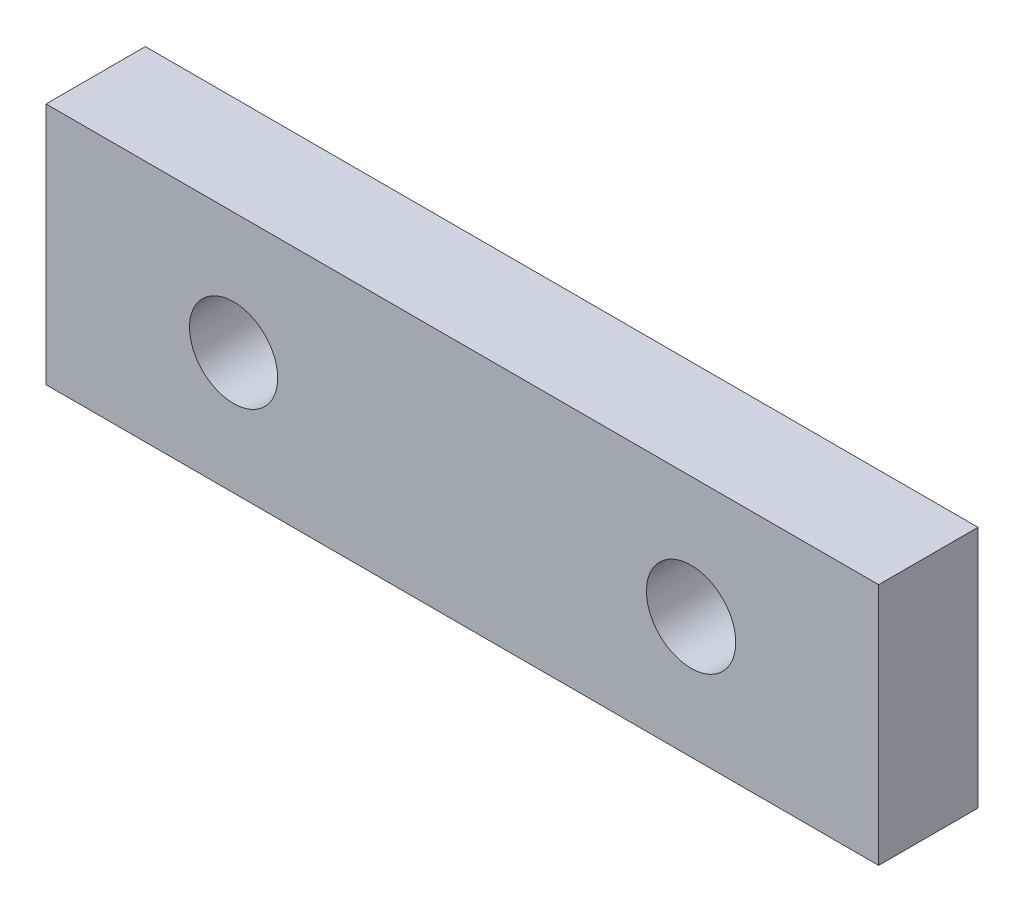
ISO-10303-21;
HEADER;
FILE_DESCRIPTION(('STEP AP214'),'2;1');
FILE_NAME('part.step','',(''),(''),'','','');
FILE_SCHEMA(('AUTOMOTIVE_DESIGN { 1 0 10303 214 1 1 1 1 }'));
ENDSEC;
DATA;
#1=APPLICATION_CONTEXT('core data for automotive mechanical design processes');
#2=APPLICATION_PROTOCOL_DEFINITION('international standard','automotive_design',2000,#1);
#3=PRODUCT_CONTEXT('',#1,'mechanical');
#4=PRODUCT('Part','Part','',(#3));
#5=PRODUCT_RELATED_PRODUCT_CATEGORY('part','',(#4));
#6=PRODUCT_DEFINITION_FORMATION('','',#4);
#7=PRODUCT_DEFINITION_CONTEXT('part definition',#1,'design');
#8=PRODUCT_DEFINITION('design','',#6,#7);
#9=PRODUCT_DEFINITION_SHAPE('','',#8);
#10=(LENGTH_UNIT() NAMED_UNIT(*) SI_UNIT(.MILLI.,.METRE.));
#11=(NAMED_UNIT(*) PLANE_ANGLE_UNIT() SI_UNIT($,.RADIAN.));
#12=(NAMED_UNIT(*) SI_UNIT($,.STERADIAN.) SOLID_ANGLE_UNIT());
#13=UNCERTAINTY_MEASURE_WITH_UNIT(LENGTH_MEASURE(1.E-05),#10,'distance_accuracy_value','');
#14=(GEOMETRIC_REPRESENTATION_CONTEXT(3) GLOBAL_UNCERTAINTY_ASSIGNED_CONTEXT((#13)) GLOBAL_UNIT_ASSIGNED_CONTEXT((#10,
#11,#12)) REPRESENTATION_CONTEXT('',''));
#15=CARTESIAN_POINT('',(0.,0.,0.));
#16=DIRECTION('',(0.,0.,1.));
#17=DIRECTION('',(1.,0.,0.));
#18=AXIS2_PLACEMENT_3D('',#15,#16,#17);
#19=CARTESIAN_POINT('',(0.,0.,9.652));
#20=DIRECTION('',(0.,0.,1.));
#21=DIRECTION('',(1.,0.,0.));
#22=AXIS2_PLACEMENT_3D('',#19,#20,#21);
#23=PLANE('',#22);
#24=CARTESIAN_POINT('',(-22.225,0.,9.652));
#25=DIRECTION('',(0.,0.,1.));
#26=DIRECTION('',(1.,0.,0.));
#27=AXIS2_PLACEMENT_3D('',#24,#25,#26);
#28=CIRCLE('',#27,4.2833011847784);
#29=CARTESIAN_POINT('',(-17.9416988152216,0.,9.652));
#30=VERTEX_POINT('',#29);
#31=EDGE_CURVE('E99',#30,#30,#28,.T.);
#32=ORIENTED_EDGE('',*,*,#31,.F.);
#33=EDGE_LOOP('',(#32));
#34=FACE_BOUND('',#33,.T.);
#35=DIRECTION('',(0.,1.,0.));
#36=VECTOR('',#35,1.);
#37=CARTESIAN_POINT('',(40.4495,11.811,9.652));
#38=LINE('',#37,#36);
#39=CARTESIAN_POINT('',(40.4495,-11.811,9.652));
#40=VERTEX_POINT('',#39);
#41=CARTESIAN_POINT('',(40.4495,11.811,9.652));
#42=VERTEX_POINT('',#41);
#43=EDGE_CURVE('E84',#40,#42,#38,.T.);
#44=ORIENTED_EDGE('',*,*,#43,.T.);
#45=DIRECTION('',(-1.,0.,0.));
#46=VECTOR('',#45,1.);
#47=CARTESIAN_POINT('',(-40.4495,11.811,9.652));
#48=LINE('',#47,#46);
#49=CARTESIAN_POINT('',(-40.4495,11.811,9.652));
#50=VERTEX_POINT('',#49);
#51=EDGE_CURVE('E79',#42,#50,#48,.T.);
#52=ORIENTED_EDGE('',*,*,#51,.T.);
#53=DIRECTION('',(0.,-1.,0.));
#54=VECTOR('',#53,1.);
#55=CARTESIAN_POINT('',(-40.4495,11.811,9.652));
#56=LINE('',#55,#54);
#57=CARTESIAN_POINT('',(-40.4495,-11.811,9.652));
#58=VERTEX_POINT('',#57);
#59=EDGE_CURVE('E82',#50,#58,#56,.T.);
#60=ORIENTED_EDGE('',*,*,#59,.T.);
#61=DIRECTION('',(1.,0.,0.));
#62=VECTOR('',#61,1.);
#63=CARTESIAN_POINT('',(-40.4495,-11.811,9.652));
#64=LINE('',#63,#62);
#65=EDGE_CURVE('E49',#58,#40,#64,.T.);
#66=ORIENTED_EDGE('',*,*,#65,.T.);
#67=EDGE_LOOP('',(#44,#52,#60,#66));
#68=FACE_BOUND('',#67,.T.);
#69=CARTESIAN_POINT('',(22.225,0.,9.652));
#70=DIRECTION('',(0.,0.,1.));
#71=DIRECTION('',(1.,0.,0.));
#72=AXIS2_PLACEMENT_3D('',#69,#70,#71);
#73=CIRCLE('',#72,4.33767023592208);
#74=CARTESIAN_POINT('',(26.5626702359221,0.,9.652));
#75=VERTEX_POINT('',#74);
#76=EDGE_CURVE('E114',#75,#75,#73,.T.);
#77=ORIENTED_EDGE('',*,*,#76,.F.);
#78=EDGE_LOOP('',(#77));
#79=FACE_BOUND('',#78,.T.);
#80=ADVANCED_FACE('F32',(#34,#68,#79),#23,.T.);
#81=CARTESIAN_POINT('',(0.,0.,0.));
#82=DIRECTION('',(0.,0.,1.));
#83=DIRECTION('',(1.,0.,0.));
#84=AXIS2_PLACEMENT_3D('',#81,#82,#83);
#85=PLANE('',#84);
#86=DIRECTION('',(0.,1.,0.));
#87=VECTOR('',#86,1.);
#88=CARTESIAN_POINT('',(40.4495,11.811,0.));
#89=LINE('',#88,#87);
#90=CARTESIAN_POINT('',(40.4495,-11.811,0.));
#91=VERTEX_POINT('',#90);
#92=CARTESIAN_POINT('',(40.4495,11.811,0.));
#93=VERTEX_POINT('',#92);
#94=EDGE_CURVE('E96',#91,#93,#89,.T.);
#95=ORIENTED_EDGE('',*,*,#94,.F.);
#96=DIRECTION('',(1.,0.,0.));
#97=VECTOR('',#96,1.);
#98=CARTESIAN_POINT('',(-40.4495,-11.811,0.));
#99=LINE('',#98,#97);
#100=CARTESIAN_POINT('',(-40.4495,-11.811,0.));
#101=VERTEX_POINT('',#100);
#102=EDGE_CURVE('E72',#101,#91,#99,.T.);
#103=ORIENTED_EDGE('',*,*,#102,.F.);
#104=DIRECTION('',(0.,-1.,0.));
#105=VECTOR('',#104,1.);
#106=CARTESIAN_POINT('',(-40.4495,11.811,0.));
#107=LINE('',#106,#105);
#108=CARTESIAN_POINT('',(-40.4495,11.811,0.));
#109=VERTEX_POINT('',#108);
#110=EDGE_CURVE('E66',#109,#101,#107,.T.);
#111=ORIENTED_EDGE('',*,*,#110,.F.);
#112=DIRECTION('',(-1.,0.,0.));
#113=VECTOR('',#112,1.);
#114=CARTESIAN_POINT('',(-40.4495,11.811,0.));
#115=LINE('',#114,#113);
#116=EDGE_CURVE('E88',#93,#109,#115,.T.);
#117=ORIENTED_EDGE('',*,*,#116,.F.);
#118=EDGE_LOOP('',(#95,#103,#111,#117));
#119=FACE_BOUND('',#118,.T.);
#120=CARTESIAN_POINT('',(-22.225,0.,0.));
#121=DIRECTION('',(0.,0.,1.));
#122=DIRECTION('',(1.,0.,0.));
#123=AXIS2_PLACEMENT_3D('',#120,#121,#122);
#124=CIRCLE('',#123,4.2833011847784);
#125=CARTESIAN_POINT('',(-17.9416988152216,0.,0.));
#126=VERTEX_POINT('',#125);
#127=EDGE_CURVE('E111',#126,#126,#124,.T.);
#128=ORIENTED_EDGE('',*,*,#127,.T.);
#129=EDGE_LOOP('',(#128));
#130=FACE_BOUND('',#129,.T.);
#131=CARTESIAN_POINT('',(22.225,0.,0.));
#132=DIRECTION('',(0.,0.,1.));
#133=DIRECTION('',(1.,0.,0.));
#134=AXIS2_PLACEMENT_3D('',#131,#132,#133);
#135=CIRCLE('',#134,4.33767023592208);
#136=CARTESIAN_POINT('',(26.5626702359221,0.,0.));
#137=VERTEX_POINT('',#136);
#138=EDGE_CURVE('E117',#137,#137,#135,.T.);
#139=ORIENTED_EDGE('',*,*,#138,.T.);
#140=EDGE_LOOP('',(#139));
#141=FACE_BOUND('',#140,.T.);
#142=ADVANCED_FACE('F107',(#119,#130,#141),#85,.F.);
#143=CARTESIAN_POINT('',(40.4495,11.811,9.652));
#144=DIRECTION('',(-1.,0.,0.));
#145=DIRECTION('',(0.,0.,1.));
#146=AXIS2_PLACEMENT_3D('',#143,#144,#145);
#147=PLANE('',#146);
#148=ORIENTED_EDGE('',*,*,#94,.T.);
#149=DIRECTION('',(0.,0.,-1.));
#150=VECTOR('',#149,1.);
#151=CARTESIAN_POINT('',(40.4495,11.811,9.652));
#152=LINE('',#151,#150);
#153=EDGE_CURVE('E11',#42,#93,#152,.T.);
#154=ORIENTED_EDGE('',*,*,#153,.F.);
#155=ORIENTED_EDGE('',*,*,#43,.F.);
#156=DIRECTION('',(0.,0.,-1.));
#157=VECTOR('',#156,1.);
#158=CARTESIAN_POINT('',(40.4495,-11.811,9.652));
#159=LINE('',#158,#157);
#160=EDGE_CURVE('E92',#40,#91,#159,.T.);
#161=ORIENTED_EDGE('',*,*,#160,.T.);
#162=EDGE_LOOP('',(#148,#154,#155,#161));
#163=FACE_BOUND('',#162,.T.);
#164=ADVANCED_FACE('F34',(#163),#147,.F.);
#165=CARTESIAN_POINT('',(-40.4495,11.811,9.652));
#166=DIRECTION('',(0.,-1.,0.));
#167=DIRECTION('',(0.,0.,-1.));
#168=AXIS2_PLACEMENT_3D('',#165,#166,#167);
#169=PLANE('',#168);
#170=ORIENTED_EDGE('',*,*,#116,.T.);
#171=DIRECTION('',(0.,0.,-1.));
#172=VECTOR('',#171,1.);
#173=CARTESIAN_POINT('',(-40.4495,11.811,9.652));
#174=LINE('',#173,#172);
#175=EDGE_CURVE('E41',#50,#109,#174,.T.);
#176=ORIENTED_EDGE('',*,*,#175,.F.);
#177=ORIENTED_EDGE('',*,*,#51,.F.);
#178=ORIENTED_EDGE('',*,*,#153,.T.);
#179=EDGE_LOOP('',(#170,#176,#177,#178));
#180=FACE_BOUND('',#179,.T.);
#181=ADVANCED_FACE('F87',(#180),#169,.F.);
#182=CARTESIAN_POINT('',(-40.4495,11.811,9.652));
#183=DIRECTION('',(1.,0.,0.));
#184=DIRECTION('',(0.,0.,-1.));
#185=AXIS2_PLACEMENT_3D('',#182,#183,#184);
#186=PLANE('',#185);
#187=ORIENTED_EDGE('',*,*,#110,.T.);
#188=DIRECTION('',(0.,0.,-1.));
#189=VECTOR('',#188,1.);
#190=CARTESIAN_POINT('',(-40.4495,-11.811,9.652));
#191=LINE('',#190,#189);
#192=EDGE_CURVE('E89',#58,#101,#191,.T.);
#193=ORIENTED_EDGE('',*,*,#192,.F.);
#194=ORIENTED_EDGE('',*,*,#59,.F.);
#195=ORIENTED_EDGE('',*,*,#175,.T.);
#196=EDGE_LOOP('',(#187,#193,#194,#195));
#197=FACE_BOUND('',#196,.T.);
#198=ADVANCED_FACE('F90',(#197),#186,.F.);
#199=CARTESIAN_POINT('',(-40.4495,-11.811,9.652));
#200=DIRECTION('',(0.,1.,0.));
#201=DIRECTION('',(0.,0.,1.));
#202=AXIS2_PLACEMENT_3D('',#199,#200,#201);
#203=PLANE('',#202);
#204=ORIENTED_EDGE('',*,*,#102,.T.);
#205=ORIENTED_EDGE('',*,*,#160,.F.);
#206=ORIENTED_EDGE('',*,*,#65,.F.);
#207=ORIENTED_EDGE('',*,*,#192,.T.);
#208=EDGE_LOOP('',(#204,#205,#206,#207));
#209=FACE_BOUND('',#208,.T.);
#210=ADVANCED_FACE('F104',(#209),#203,.F.);
#211=CARTESIAN_POINT('',(-22.225,0.,9.652));
#212=DIRECTION('',(0.,0.,-1.));
#213=DIRECTION('',(-1.,0.,0.));
#214=AXIS2_PLACEMENT_3D('',#211,#212,#213);
#215=CYLINDRICAL_SURFACE('',#214,4.2833011847784);
#216=ORIENTED_EDGE('',*,*,#31,.T.);
#217=EDGE_LOOP('',(#216));
#218=FACE_BOUND('',#217,.T.);
#219=ORIENTED_EDGE('',*,*,#127,.F.);
#220=EDGE_LOOP('',(#219));
#221=FACE_BOUND('',#220,.T.);
#222=ADVANCED_FACE('F134',(#218,#221),#215,.F.);
#223=CARTESIAN_POINT('',(22.225,0.,9.652));
#224=DIRECTION('',(0.,0.,-1.));
#225=DIRECTION('',(-1.,0.,0.));
#226=AXIS2_PLACEMENT_3D('',#223,#224,#225);
#227=CYLINDRICAL_SURFACE('',#226,4.33767023592208);
#228=ORIENTED_EDGE('',*,*,#76,.T.);
#229=EDGE_LOOP('',(#228));
#230=FACE_BOUND('',#229,.T.);
#231=ORIENTED_EDGE('',*,*,#138,.F.);
#232=EDGE_LOOP('',(#231));
#233=FACE_BOUND('',#232,.T.);
#234=ADVANCED_FACE('F123',(#230,#233),#227,.F.);
#235=CLOSED_SHELL('',(#80,#142,#164,#181,#198,#210,#222,#234));
#236=MANIFOLD_SOLID_BREP('B2',#235);
#237=ADVANCED_BREP_SHAPE_REPRESENTATION('',(#18,#236),#14);
#238=SHAPE_DEFINITION_REPRESENTATION(#9,#237);
ENDSEC;
END-ISO-10303-21;
